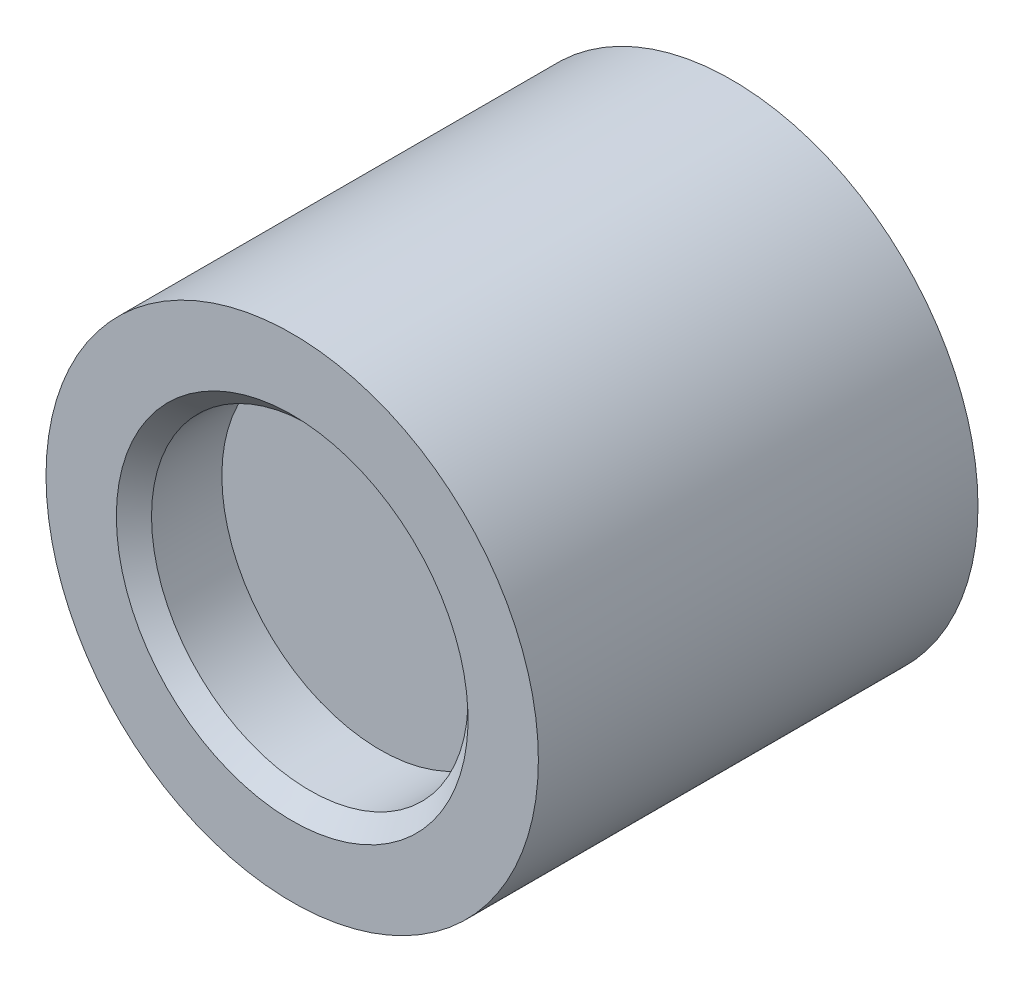
ISO-10303-21;
HEADER;
FILE_DESCRIPTION(('STEP AP214'),'2;1');
FILE_NAME('part.step','',(''),(''),'','','');
FILE_SCHEMA(('AUTOMOTIVE_DESIGN { 1 0 10303 214 1 1 1 1 }'));
ENDSEC;
DATA;
#1=APPLICATION_CONTEXT('core data for automotive mechanical design processes');
#2=APPLICATION_PROTOCOL_DEFINITION('international standard','automotive_design',2000,#1);
#3=PRODUCT_CONTEXT('',#1,'mechanical');
#4=PRODUCT('Part','Part','',(#3));
#5=PRODUCT_RELATED_PRODUCT_CATEGORY('part','',(#4));
#6=PRODUCT_DEFINITION_FORMATION('','',#4);
#7=PRODUCT_DEFINITION_CONTEXT('part definition',#1,'design');
#8=PRODUCT_DEFINITION('design','',#6,#7);
#9=PRODUCT_DEFINITION_SHAPE('','',#8);
#10=(LENGTH_UNIT() NAMED_UNIT(*) SI_UNIT(.MILLI.,.METRE.));
#11=(NAMED_UNIT(*) PLANE_ANGLE_UNIT() SI_UNIT($,.RADIAN.));
#12=(NAMED_UNIT(*) SI_UNIT($,.STERADIAN.) SOLID_ANGLE_UNIT());
#13=UNCERTAINTY_MEASURE_WITH_UNIT(LENGTH_MEASURE(1.E-05),#10,'distance_accuracy_value','');
#14=(GEOMETRIC_REPRESENTATION_CONTEXT(3) GLOBAL_UNCERTAINTY_ASSIGNED_CONTEXT((#13)) GLOBAL_UNIT_ASSIGNED_CONTEXT((#10,
#11,#12)) REPRESENTATION_CONTEXT('',''));
#15=CARTESIAN_POINT('',(0.,0.,0.));
#16=DIRECTION('',(0.,0.,1.));
#17=DIRECTION('',(1.,0.,0.));
#18=AXIS2_PLACEMENT_3D('',#15,#16,#17);
#19=CARTESIAN_POINT('',(0.,0.,0.25));
#20=DIRECTION('',(0.,0.,1.));
#21=DIRECTION('',(1.,0.,0.));
#22=AXIS2_PLACEMENT_3D('',#19,#20,#21);
#23=CYLINDRICAL_SURFACE('',#22,2.25);
#24=CARTESIAN_POINT('',(0.,0.,6.25));
#25=DIRECTION('',(0.,0.,-1.));
#26=DIRECTION('',(1.,0.,0.));
#27=AXIS2_PLACEMENT_3D('',#24,#25,#26);
#28=CIRCLE('',#27,2.25);
#29=CARTESIAN_POINT('',(-2.25,0.,6.25));
#30=VERTEX_POINT('',#29);
#31=EDGE_CURVE('E26',#30,#30,#28,.T.);
#32=ORIENTED_EDGE('',*,*,#31,.F.);
#33=DIRECTION('',(0.,0.,-1.));
#34=VECTOR('',#33,1.);
#35=CARTESIAN_POINT('',(-2.25,0.,0.25));
#36=LINE('',#35,#34);
#37=CARTESIAN_POINT('',(-2.25,0.,5.25));
#38=VERTEX_POINT('',#37);
#39=EDGE_CURVE('E11',#30,#38,#36,.T.);
#40=ORIENTED_EDGE('',*,*,#39,.T.);
#41=CARTESIAN_POINT('',(0.,0.,5.25));
#42=DIRECTION('',(0.,0.,-1.));
#43=DIRECTION('',(1.,0.,0.));
#44=AXIS2_PLACEMENT_3D('',#41,#42,#43);
#45=CIRCLE('',#44,2.25);
#46=EDGE_CURVE('E20',#38,#38,#45,.T.);
#47=ORIENTED_EDGE('',*,*,#46,.T.);
#48=ORIENTED_EDGE('',*,*,#39,.F.);
#49=EDGE_LOOP('',(#32,#40,#47,#48));
#50=FACE_BOUND('',#49,.T.);
#51=ADVANCED_FACE('F16',(#50),#23,.F.);
#52=CARTESIAN_POINT('',(0.,0.,6.375));
#53=DIRECTION('',(0.,0.,1.));
#54=DIRECTION('',(1.,0.,0.));
#55=AXIS2_PLACEMENT_3D('',#52,#53,#54);
#56=CONICAL_SURFACE('',#55,2.375,0.785398163397448);
#57=CARTESIAN_POINT('',(0.,0.,6.5));
#58=DIRECTION('',(0.,0.,1.));
#59=DIRECTION('',(1.,0.,0.));
#60=AXIS2_PLACEMENT_3D('',#57,#58,#59);
#61=CIRCLE('',#60,2.5);
#62=CARTESIAN_POINT('',(-2.5,0.,6.5));
#63=VERTEX_POINT('',#62);
#64=EDGE_CURVE('E64',#63,#63,#61,.T.);
#65=ORIENTED_EDGE('',*,*,#64,.T.);
#66=DIRECTION('',(0.707106781186547,0.,-0.707106781186548));
#67=VECTOR('',#66,1.);
#68=CARTESIAN_POINT('',(-2.375,0.,6.375));
#69=LINE('',#68,#67);
#70=EDGE_CURVE('E78',#63,#30,#69,.T.);
#71=ORIENTED_EDGE('',*,*,#70,.T.);
#72=ORIENTED_EDGE('',*,*,#31,.T.);
#73=ORIENTED_EDGE('',*,*,#70,.F.);
#74=EDGE_LOOP('',(#65,#71,#72,#73));
#75=FACE_BOUND('',#74,.T.);
#76=ADVANCED_FACE('F84',(#75),#56,.F.);
#77=CARTESIAN_POINT('',(0.,0.,0.25));
#78=DIRECTION('',(0.,0.,1.));
#79=DIRECTION('',(1.,0.,0.));
#80=AXIS2_PLACEMENT_3D('',#77,#78,#79);
#81=PLANE('',#80);
#82=CARTESIAN_POINT('',(0.,0.,0.25));
#83=DIRECTION('',(0.,0.,1.));
#84=DIRECTION('',(1.,0.,0.));
#85=AXIS2_PLACEMENT_3D('',#82,#83,#84);
#86=CIRCLE('',#85,3.5);
#87=CARTESIAN_POINT('',(-3.5,0.,0.25));
#88=VERTEX_POINT('',#87);
#89=EDGE_CURVE('E49',#88,#88,#86,.T.);
#90=ORIENTED_EDGE('',*,*,#89,.F.);
#91=EDGE_LOOP('',(#90));
#92=FACE_BOUND('',#91,.T.);
#93=ADVANCED_FACE('F90',(#92),#81,.F.);
#94=CARTESIAN_POINT('',(0.,0.,0.25));
#95=DIRECTION('',(0.,0.,1.));
#96=DIRECTION('',(1.,0.,0.));
#97=AXIS2_PLACEMENT_3D('',#94,#95,#96);
#98=CYLINDRICAL_SURFACE('',#97,3.5);
#99=CARTESIAN_POINT('',(0.,0.,6.5));
#100=DIRECTION('',(0.,0.,1.));
#101=DIRECTION('',(1.,0.,0.));
#102=AXIS2_PLACEMENT_3D('',#99,#100,#101);
#103=CIRCLE('',#102,3.5);
#104=CARTESIAN_POINT('',(-3.5,0.,6.5));
#105=VERTEX_POINT('',#104);
#106=EDGE_CURVE('E62',#105,#105,#103,.T.);
#107=ORIENTED_EDGE('',*,*,#106,.F.);
#108=DIRECTION('',(0.,0.,-1.));
#109=VECTOR('',#108,1.);
#110=CARTESIAN_POINT('',(-3.5,0.,0.25));
#111=LINE('',#110,#109);
#112=EDGE_CURVE('E59',#105,#88,#111,.T.);
#113=ORIENTED_EDGE('',*,*,#112,.T.);
#114=ORIENTED_EDGE('',*,*,#89,.T.);
#115=ORIENTED_EDGE('',*,*,#112,.F.);
#116=EDGE_LOOP('',(#107,#113,#114,#115));
#117=FACE_BOUND('',#116,.T.);
#118=ADVANCED_FACE('F61',(#117),#98,.T.);
#119=CARTESIAN_POINT('',(0.,0.,6.5));
#120=DIRECTION('',(0.,0.,1.));
#121=DIRECTION('',(1.,0.,0.));
#122=AXIS2_PLACEMENT_3D('',#119,#120,#121);
#123=PLANE('',#122);
#124=ORIENTED_EDGE('',*,*,#64,.F.);
#125=EDGE_LOOP('',(#124));
#126=FACE_BOUND('',#125,.T.);
#127=ORIENTED_EDGE('',*,*,#106,.T.);
#128=EDGE_LOOP('',(#127));
#129=FACE_BOUND('',#128,.T.);
#130=ADVANCED_FACE('F18',(#126,#129),#123,.T.);
#131=CARTESIAN_POINT('',(0.,0.,5.25));
#132=DIRECTION('',(0.,0.,1.));
#133=DIRECTION('',(1.,0.,0.));
#134=AXIS2_PLACEMENT_3D('',#131,#132,#133);
#135=PLANE('',#134);
#136=ORIENTED_EDGE('',*,*,#46,.F.);
#137=EDGE_LOOP('',(#136));
#138=FACE_BOUND('',#137,.T.);
#139=ADVANCED_FACE('F95',(#138),#135,.T.);
#140=CLOSED_SHELL('',(#51,#76,#93,#118,#130,#139));
#141=MANIFOLD_SOLID_BREP('B1',#140);
#142=ADVANCED_BREP_SHAPE_REPRESENTATION('',(#18,#141),#14);
#143=SHAPE_DEFINITION_REPRESENTATION(#9,#142);
ENDSEC;
END-ISO-10303-21;
